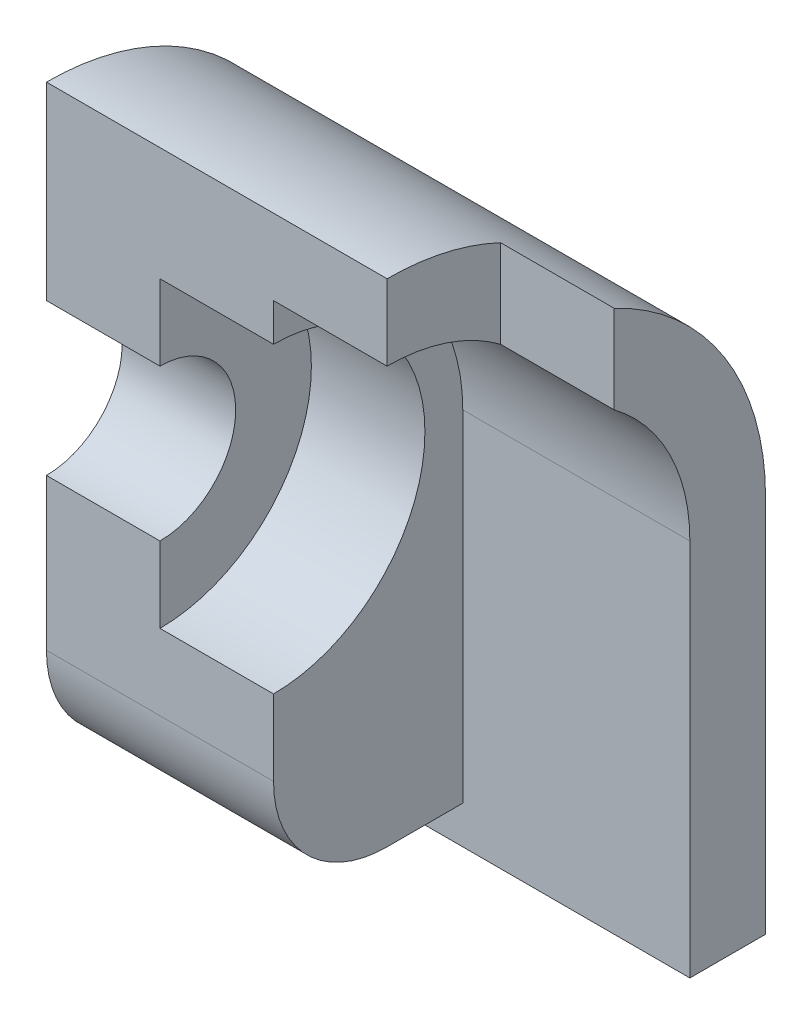
ISO-10303-21;
HEADER;
FILE_DESCRIPTION(('STEP AP214'),'2;1');
FILE_NAME('part.step','',(''),(''),'','','');
FILE_SCHEMA(('AUTOMOTIVE_DESIGN { 1 0 10303 214 1 1 1 1 }'));
ENDSEC;
DATA;
#1=APPLICATION_CONTEXT('core data for automotive mechanical design processes');
#2=APPLICATION_PROTOCOL_DEFINITION('international standard','automotive_design',2000,#1);
#3=PRODUCT_CONTEXT('',#1,'mechanical');
#4=PRODUCT('Part','Part','',(#3));
#5=PRODUCT_RELATED_PRODUCT_CATEGORY('part','',(#4));
#6=PRODUCT_DEFINITION_FORMATION('','',#4);
#7=PRODUCT_DEFINITION_CONTEXT('part definition',#1,'design');
#8=PRODUCT_DEFINITION('design','',#6,#7);
#9=PRODUCT_DEFINITION_SHAPE('','',#8);
#10=(LENGTH_UNIT() NAMED_UNIT(*) SI_UNIT(.MILLI.,.METRE.));
#11=(NAMED_UNIT(*) PLANE_ANGLE_UNIT() SI_UNIT($,.RADIAN.));
#12=(NAMED_UNIT(*) SI_UNIT($,.STERADIAN.) SOLID_ANGLE_UNIT());
#13=UNCERTAINTY_MEASURE_WITH_UNIT(LENGTH_MEASURE(1.E-05),#10,'distance_accuracy_value','');
#14=(GEOMETRIC_REPRESENTATION_CONTEXT(3) GLOBAL_UNCERTAINTY_ASSIGNED_CONTEXT((#13)) GLOBAL_UNIT_ASSIGNED_CONTEXT((#10,
#11,#12)) REPRESENTATION_CONTEXT('',''));
#15=CARTESIAN_POINT('',(0.,0.,0.));
#16=DIRECTION('',(0.,0.,1.));
#17=DIRECTION('',(1.,0.,0.));
#18=AXIS2_PLACEMENT_3D('',#15,#16,#17);
#19=CARTESIAN_POINT('',(12.,1.,3.5));
#20=DIRECTION('',(-1.,0.,0.));
#21=DIRECTION('',(0.,0.,1.));
#22=AXIS2_PLACEMENT_3D('',#19,#20,#21);
#23=CYLINDRICAL_SURFACE('',#22,2.);
#24=DIRECTION('',(-1.,0.,0.));
#25=VECTOR('',#24,1.);
#26=CARTESIAN_POINT('',(12.,-0.999999999999997,3.5));
#27=LINE('',#26,#25);
#28=CARTESIAN_POINT('',(3.,-0.999999999999997,3.5));
#29=VERTEX_POINT('',#28);
#30=CARTESIAN_POINT('',(0.,-0.999999999999997,3.5));
#31=VERTEX_POINT('',#30);
#32=EDGE_CURVE('E184',#29,#31,#27,.T.);
#33=ORIENTED_EDGE('',*,*,#32,.F.);
#34=CARTESIAN_POINT('',(3.,1.,3.5));
#35=DIRECTION('',(1.,0.,0.));
#36=DIRECTION('',(0.,0.,-1.));
#37=AXIS2_PLACEMENT_3D('',#34,#35,#36);
#38=CIRCLE('',#37,2.);
#39=CARTESIAN_POINT('',(3.,3.,3.5));
#40=VERTEX_POINT('',#39);
#41=EDGE_CURVE('E269',#29,#40,#38,.T.);
#42=ORIENTED_EDGE('',*,*,#41,.T.);
#43=DIRECTION('',(-1.,0.,0.));
#44=VECTOR('',#43,1.);
#45=CARTESIAN_POINT('',(12.,3.,3.5));
#46=LINE('',#45,#44);
#47=CARTESIAN_POINT('',(0.,3.,3.5));
#48=VERTEX_POINT('',#47);
#49=EDGE_CURVE('E156',#40,#48,#46,.T.);
#50=ORIENTED_EDGE('',*,*,#49,.T.);
#51=CARTESIAN_POINT('',(0.,1.,3.5));
#52=DIRECTION('',(1.,0.,0.));
#53=DIRECTION('',(0.,0.,-1.));
#54=AXIS2_PLACEMENT_3D('',#51,#52,#53);
#55=CIRCLE('',#54,2.);
#56=EDGE_CURVE('E235',#31,#48,#55,.T.);
#57=ORIENTED_EDGE('',*,*,#56,.F.);
#58=EDGE_LOOP('',(#33,#42,#50,#57));
#59=FACE_BOUND('',#58,.T.);
#60=ADVANCED_FACE('F35',(#59),#23,.F.);
#61=CARTESIAN_POINT('',(12.,0.,3.5));
#62=DIRECTION('',(0.,0.,1.));
#63=DIRECTION('',(1.,0.,0.));
#64=AXIS2_PLACEMENT_3D('',#61,#62,#63);
#65=PLANE('',#64);
#66=DIRECTION('',(1.,0.,0.));
#67=VECTOR('',#66,1.);
#68=CARTESIAN_POINT('',(3.,-3.,3.5));
#69=LINE('',#68,#67);
#70=CARTESIAN_POINT('',(3.,-3.,3.5));
#71=VERTEX_POINT('',#70);
#72=CARTESIAN_POINT('',(6.,-3.,3.5));
#73=VERTEX_POINT('',#72);
#74=EDGE_CURVE('E49',#71,#73,#69,.T.);
#75=ORIENTED_EDGE('',*,*,#74,.F.);
#76=DIRECTION('',(0.,1.,0.));
#77=VECTOR('',#76,1.);
#78=CARTESIAN_POINT('',(3.,0.,3.5));
#79=LINE('',#78,#77);
#80=EDGE_CURVE('E151',#71,#29,#79,.T.);
#81=ORIENTED_EDGE('',*,*,#80,.T.);
#82=ORIENTED_EDGE('',*,*,#32,.T.);
#83=DIRECTION('',(0.,1.,0.));
#84=VECTOR('',#83,1.);
#85=CARTESIAN_POINT('',(0.,0.,3.5));
#86=LINE('',#85,#84);
#87=CARTESIAN_POINT('',(0.,-4.99999999999998,3.5));
#88=VERTEX_POINT('',#87);
#89=EDGE_CURVE('E244',#88,#31,#86,.T.);
#90=ORIENTED_EDGE('',*,*,#89,.F.);
#91=DIRECTION('',(-1.,0.,0.));
#92=VECTOR('',#91,1.);
#93=CARTESIAN_POINT('',(12.,-4.99999999999998,3.5));
#94=LINE('',#93,#92);
#95=CARTESIAN_POINT('',(6.,-4.99999999999998,3.5));
#96=VERTEX_POINT('',#95);
#97=EDGE_CURVE('E182',#96,#88,#94,.T.);
#98=ORIENTED_EDGE('',*,*,#97,.F.);
#99=DIRECTION('',(0.,1.,0.));
#100=VECTOR('',#99,1.);
#101=CARTESIAN_POINT('',(6.,0.,3.5));
#102=LINE('',#101,#100);
#103=EDGE_CURVE('E202',#96,#73,#102,.T.);
#104=ORIENTED_EDGE('',*,*,#103,.T.);
#105=EDGE_LOOP('',(#75,#81,#82,#90,#98,#104));
#106=FACE_BOUND('',#105,.T.);
#107=ADVANCED_FACE('F271',(#106),#65,.T.);
#108=CARTESIAN_POINT('',(12.,-5.,0.500000000000001));
#109=DIRECTION('',(-1.,0.,0.));
#110=DIRECTION('',(0.,0.,1.));
#111=AXIS2_PLACEMENT_3D('',#108,#109,#110);
#112=CYLINDRICAL_SURFACE('',#111,3.);
#113=DIRECTION('',(-1.,0.,0.));
#114=VECTOR('',#113,1.);
#115=CARTESIAN_POINT('',(12.,-8.,0.499999999999979));
#116=LINE('',#115,#114);
#117=CARTESIAN_POINT('',(6.,-8.,0.499999999999979));
#118=VERTEX_POINT('',#117);
#119=CARTESIAN_POINT('',(0.,-8.,0.499999999999979));
#120=VERTEX_POINT('',#119);
#121=EDGE_CURVE('E180',#118,#120,#116,.T.);
#122=ORIENTED_EDGE('',*,*,#121,.F.);
#123=CARTESIAN_POINT('',(6.,-5.,0.500000000000001));
#124=DIRECTION('',(1.,0.,0.));
#125=DIRECTION('',(0.,0.,-1.));
#126=AXIS2_PLACEMENT_3D('',#123,#124,#125);
#127=CIRCLE('',#126,3.);
#128=EDGE_CURVE('E220',#118,#96,#127,.F.);
#129=ORIENTED_EDGE('',*,*,#128,.T.);
#130=ORIENTED_EDGE('',*,*,#97,.T.);
#131=CARTESIAN_POINT('',(0.,-5.,0.500000000000001));
#132=DIRECTION('',(1.,0.,0.));
#133=DIRECTION('',(0.,0.,-1.));
#134=AXIS2_PLACEMENT_3D('',#131,#132,#133);
#135=CIRCLE('',#134,3.);
#136=EDGE_CURVE('E247',#120,#88,#135,.F.);
#137=ORIENTED_EDGE('',*,*,#136,.F.);
#138=EDGE_LOOP('',(#122,#129,#130,#137));
#139=FACE_BOUND('',#138,.T.);
#140=ADVANCED_FACE('F276',(#139),#112,.T.);
#141=CARTESIAN_POINT('',(12.,-8.,0.));
#142=DIRECTION('',(0.,-1.,0.));
#143=DIRECTION('',(0.,0.,-1.));
#144=AXIS2_PLACEMENT_3D('',#141,#142,#143);
#145=PLANE('',#144);
#146=DIRECTION('',(-1.,0.,0.));
#147=VECTOR('',#146,1.);
#148=CARTESIAN_POINT('',(12.,-8.,-1.5));
#149=LINE('',#148,#147);
#150=CARTESIAN_POINT('',(6.,-8.,-1.5));
#151=VERTEX_POINT('',#150);
#152=CARTESIAN_POINT('',(0.,-8.,-1.5));
#153=VERTEX_POINT('',#152);
#154=EDGE_CURVE('E178',#151,#153,#149,.T.);
#155=ORIENTED_EDGE('',*,*,#154,.F.);
#156=DIRECTION('',(0.,0.,1.));
#157=VECTOR('',#156,1.);
#158=CARTESIAN_POINT('',(6.,-8.,0.));
#159=LINE('',#158,#157);
#160=EDGE_CURVE('E223',#151,#118,#159,.T.);
#161=ORIENTED_EDGE('',*,*,#160,.T.);
#162=ORIENTED_EDGE('',*,*,#121,.T.);
#163=DIRECTION('',(0.,0.,1.));
#164=VECTOR('',#163,1.);
#165=CARTESIAN_POINT('',(0.,-8.,0.));
#166=LINE('',#165,#164);
#167=EDGE_CURVE('E250',#153,#120,#166,.T.);
#168=ORIENTED_EDGE('',*,*,#167,.F.);
#169=EDGE_LOOP('',(#155,#161,#162,#168));
#170=FACE_BOUND('',#169,.T.);
#171=ADVANCED_FACE('F281',(#170),#145,.T.);
#172=CARTESIAN_POINT('',(12.,0.,-1.5));
#173=DIRECTION('',(0.,0.,-1.));
#174=DIRECTION('',(-1.,0.,0.));
#175=AXIS2_PLACEMENT_3D('',#172,#173,#174);
#176=PLANE('',#175);
#177=DIRECTION('',(-1.,0.,0.));
#178=VECTOR('',#177,1.);
#179=CARTESIAN_POINT('',(12.,-9.,-1.5));
#180=LINE('',#179,#178);
#181=CARTESIAN_POINT('',(12.,-9.,-1.5));
#182=VERTEX_POINT('',#181);
#183=CARTESIAN_POINT('',(0.,-9.,-1.5));
#184=VERTEX_POINT('',#183);
#185=EDGE_CURVE('E176',#182,#184,#180,.T.);
#186=ORIENTED_EDGE('',*,*,#185,.F.);
#187=DIRECTION('',(0.,-1.,0.));
#188=VECTOR('',#187,1.);
#189=CARTESIAN_POINT('',(12.,0.,-1.5));
#190=LINE('',#189,#188);
#191=CARTESIAN_POINT('',(12.,1.,-1.5));
#192=VERTEX_POINT('',#191);
#193=EDGE_CURVE('E236',#192,#182,#190,.T.);
#194=ORIENTED_EDGE('',*,*,#193,.F.);
#195=DIRECTION('',(1.,0.,0.));
#196=VECTOR('',#195,1.);
#197=CARTESIAN_POINT('',(6.,1.,-1.5));
#198=LINE('',#197,#196);
#199=CARTESIAN_POINT('',(6.,1.,-1.5));
#200=VERTEX_POINT('',#199);
#201=EDGE_CURVE('E210',#200,#192,#198,.T.);
#202=ORIENTED_EDGE('',*,*,#201,.F.);
#203=DIRECTION('',(0.,1.,0.));
#204=VECTOR('',#203,1.);
#205=CARTESIAN_POINT('',(6.,1.,-1.5));
#206=LINE('',#205,#204);
#207=EDGE_CURVE('E206',#151,#200,#206,.T.);
#208=ORIENTED_EDGE('',*,*,#207,.F.);
#209=ORIENTED_EDGE('',*,*,#154,.T.);
#210=DIRECTION('',(0.,-1.,0.));
#211=VECTOR('',#210,1.);
#212=CARTESIAN_POINT('',(0.,0.,-1.5));
#213=LINE('',#212,#211);
#214=EDGE_CURVE('E253',#153,#184,#213,.T.);
#215=ORIENTED_EDGE('',*,*,#214,.T.);
#216=EDGE_LOOP('',(#186,#194,#202,#208,#209,#215));
#217=FACE_BOUND('',#216,.T.);
#218=ADVANCED_FACE('F284',(#217),#176,.F.);
#219=CARTESIAN_POINT('',(12.,-9.,0.));
#220=DIRECTION('',(0.,-1.,0.));
#221=DIRECTION('',(0.,0.,-1.));
#222=AXIS2_PLACEMENT_3D('',#219,#220,#221);
#223=PLANE('',#222);
#224=DIRECTION('',(0.,0.,1.));
#225=VECTOR('',#224,1.);
#226=CARTESIAN_POINT('',(0.,-9.,0.));
#227=LINE('',#226,#225);
#228=CARTESIAN_POINT('',(0.,-9.,-3.5));
#229=VERTEX_POINT('',#228);
#230=EDGE_CURVE('E256',#229,#184,#227,.T.);
#231=ORIENTED_EDGE('',*,*,#230,.F.);
#232=DIRECTION('',(-1.,0.,0.));
#233=VECTOR('',#232,1.);
#234=CARTESIAN_POINT('',(12.,-9.,-3.5));
#235=LINE('',#234,#233);
#236=CARTESIAN_POINT('',(12.,-9.,-3.5));
#237=VERTEX_POINT('',#236);
#238=EDGE_CURVE('E174',#237,#229,#235,.T.);
#239=ORIENTED_EDGE('',*,*,#238,.F.);
#240=DIRECTION('',(0.,0.,1.));
#241=VECTOR('',#240,1.);
#242=CARTESIAN_POINT('',(12.,-9.,0.));
#243=LINE('',#242,#241);
#244=EDGE_CURVE('E238',#237,#182,#243,.T.);
#245=ORIENTED_EDGE('',*,*,#244,.T.);
#246=ORIENTED_EDGE('',*,*,#185,.T.);
#247=EDGE_LOOP('',(#231,#239,#245,#246));
#248=FACE_BOUND('',#247,.T.);
#249=ADVANCED_FACE('F306',(#248),#223,.T.);
#250=CARTESIAN_POINT('',(12.,0.,-3.5));
#251=DIRECTION('',(0.,0.,1.));
#252=DIRECTION('',(1.,0.,0.));
#253=AXIS2_PLACEMENT_3D('',#250,#251,#252);
#254=PLANE('',#253);
#255=DIRECTION('',(0.,1.,0.));
#256=VECTOR('',#255,1.);
#257=CARTESIAN_POINT('',(0.,0.,-3.5));
#258=LINE('',#257,#256);
#259=CARTESIAN_POINT('',(0.,1.,-3.5));
#260=VERTEX_POINT('',#259);
#261=EDGE_CURVE('E258',#229,#260,#258,.T.);
#262=ORIENTED_EDGE('',*,*,#261,.T.);
#263=DIRECTION('',(-1.,0.,0.));
#264=VECTOR('',#263,1.);
#265=CARTESIAN_POINT('',(12.,1.,-3.5));
#266=LINE('',#265,#264);
#267=CARTESIAN_POINT('',(12.,1.,-3.5));
#268=VERTEX_POINT('',#267);
#269=EDGE_CURVE('E165',#268,#260,#266,.T.);
#270=ORIENTED_EDGE('',*,*,#269,.F.);
#271=DIRECTION('',(0.,1.,0.));
#272=VECTOR('',#271,1.);
#273=CARTESIAN_POINT('',(12.,0.,-3.5));
#274=LINE('',#273,#272);
#275=EDGE_CURVE('E167',#237,#268,#274,.T.);
#276=ORIENTED_EDGE('',*,*,#275,.F.);
#277=ORIENTED_EDGE('',*,*,#238,.T.);
#278=EDGE_LOOP('',(#262,#270,#276,#277));
#279=FACE_BOUND('',#278,.T.);
#280=ADVANCED_FACE('F303',(#279),#254,.F.);
#281=CARTESIAN_POINT('',(12.,1.,3.5));
#282=DIRECTION('',(-1.,0.,0.));
#283=DIRECTION('',(0.,0.,1.));
#284=AXIS2_PLACEMENT_3D('',#281,#282,#283);
#285=CYLINDRICAL_SURFACE('',#284,7.);
#286=DIRECTION('',(-1.,0.,0.));
#287=VECTOR('',#286,1.);
#288=CARTESIAN_POINT('',(12.,7.32455532033675,0.499999999999979));
#289=LINE('',#288,#287);
#290=CARTESIAN_POINT('',(12.,7.32455532033675,0.499999999999979));
#291=VERTEX_POINT('',#290);
#292=CARTESIAN_POINT('',(9.,7.32455532033675,0.499999999999979));
#293=VERTEX_POINT('',#292);
#294=EDGE_CURVE('E230',#291,#293,#289,.T.);
#295=ORIENTED_EDGE('',*,*,#294,.F.);
#296=CARTESIAN_POINT('',(12.,1.,3.5));
#297=DIRECTION('',(1.,0.,0.));
#298=DIRECTION('',(0.,0.,-1.));
#299=AXIS2_PLACEMENT_3D('',#296,#297,#298);
#300=CIRCLE('',#299,7.);
#301=EDGE_CURVE('E163',#291,#268,#300,.F.);
#302=ORIENTED_EDGE('',*,*,#301,.T.);
#303=ORIENTED_EDGE('',*,*,#269,.T.);
#304=CARTESIAN_POINT('',(0.,1.,3.5));
#305=DIRECTION('',(1.,0.,0.));
#306=DIRECTION('',(0.,0.,-1.));
#307=AXIS2_PLACEMENT_3D('',#304,#305,#306);
#308=CIRCLE('',#307,7.);
#309=CARTESIAN_POINT('',(0.,8.,3.5));
#310=VERTEX_POINT('',#309);
#311=EDGE_CURVE('E170',#310,#260,#308,.F.);
#312=ORIENTED_EDGE('',*,*,#311,.F.);
#313=DIRECTION('',(-1.,0.,0.));
#314=VECTOR('',#313,1.);
#315=CARTESIAN_POINT('',(12.,8.,3.5));
#316=LINE('',#315,#314);
#317=CARTESIAN_POINT('',(9.,8.,3.5));
#318=VERTEX_POINT('',#317);
#319=EDGE_CURVE('E162',#318,#310,#316,.T.);
#320=ORIENTED_EDGE('',*,*,#319,.F.);
#321=CARTESIAN_POINT('',(9.,1.,3.5));
#322=DIRECTION('',(-1.,0.,0.));
#323=DIRECTION('',(0.,0.,1.));
#324=AXIS2_PLACEMENT_3D('',#321,#322,#323);
#325=CIRCLE('',#324,7.);
#326=EDGE_CURVE('E233',#293,#318,#325,.F.);
#327=ORIENTED_EDGE('',*,*,#326,.F.);
#328=EDGE_LOOP('',(#295,#302,#303,#312,#320,#327));
#329=FACE_BOUND('',#328,.T.);
#330=ADVANCED_FACE('F298',(#329),#285,.T.);
#331=DIRECTION('',(1.,0.,0.));
#332=VECTOR('',#331,1.);
#333=CARTESIAN_POINT('',(3.,5.,3.5));
#334=LINE('',#333,#332);
#335=CARTESIAN_POINT('',(6.,5.,3.5));
#336=VERTEX_POINT('',#335);
#337=CARTESIAN_POINT('',(3.,5.,3.5));
#338=VERTEX_POINT('',#337);
#339=EDGE_CURVE('E140',#336,#338,#334,.F.);
#340=ORIENTED_EDGE('',*,*,#339,.F.);
#341=DIRECTION('',(0.,1.,0.));
#342=VECTOR('',#341,1.);
#343=CARTESIAN_POINT('',(6.,0.,3.5));
#344=LINE('',#343,#342);
#345=CARTESIAN_POINT('',(6.,6.,3.5));
#346=VERTEX_POINT('',#345);
#347=EDGE_CURVE('E190',#336,#346,#344,.T.);
#348=ORIENTED_EDGE('',*,*,#347,.T.);
#349=DIRECTION('',(1.,0.,0.));
#350=VECTOR('',#349,1.);
#351=CARTESIAN_POINT('',(6.,6.,3.5));
#352=LINE('',#351,#350);
#353=CARTESIAN_POINT('',(9.,6.,3.5));
#354=VERTEX_POINT('',#353);
#355=EDGE_CURVE('E194',#354,#346,#352,.F.);
#356=ORIENTED_EDGE('',*,*,#355,.F.);
#357=DIRECTION('',(0.,-1.,0.));
#358=VECTOR('',#357,1.);
#359=CARTESIAN_POINT('',(9.,13.,3.5));
#360=LINE('',#359,#358);
#361=EDGE_CURVE('E226',#318,#354,#360,.T.);
#362=ORIENTED_EDGE('',*,*,#361,.F.);
#363=ORIENTED_EDGE('',*,*,#319,.T.);
#364=EDGE_CURVE('E158',#48,#310,#86,.T.);
#365=ORIENTED_EDGE('',*,*,#364,.F.);
#366=ORIENTED_EDGE('',*,*,#49,.F.);
#367=DIRECTION('',(0.,1.,0.));
#368=VECTOR('',#367,1.);
#369=CARTESIAN_POINT('',(3.,0.,3.5));
#370=LINE('',#369,#368);
#371=EDGE_CURVE('E11',#40,#338,#370,.T.);
#372=ORIENTED_EDGE('',*,*,#371,.T.);
#373=EDGE_LOOP('',(#340,#348,#356,#362,#363,#365,#366,#372));
#374=FACE_BOUND('',#373,.T.);
#375=ADVANCED_FACE('F154',(#374),#65,.T.);
#376=CARTESIAN_POINT('',(12.,0.,0.));
#377=DIRECTION('',(1.,0.,0.));
#378=DIRECTION('',(0.,0.,-1.));
#379=AXIS2_PLACEMENT_3D('',#376,#377,#378);
#380=PLANE('',#379);
#381=CARTESIAN_POINT('',(12.,1.,3.5));
#382=DIRECTION('',(1.,0.,0.));
#383=DIRECTION('',(0.,0.,-1.));
#384=AXIS2_PLACEMENT_3D('',#381,#382,#383);
#385=CIRCLE('',#384,5.);
#386=CARTESIAN_POINT('',(12.,4.99999999999999,0.499999999999979));
#387=VERTEX_POINT('',#386);
#388=EDGE_CURVE('E208',#192,#387,#385,.T.);
#389=ORIENTED_EDGE('',*,*,#388,.F.);
#390=ORIENTED_EDGE('',*,*,#193,.T.);
#391=ORIENTED_EDGE('',*,*,#244,.F.);
#392=ORIENTED_EDGE('',*,*,#275,.T.);
#393=ORIENTED_EDGE('',*,*,#301,.F.);
#394=DIRECTION('',(0.,1.,0.));
#395=VECTOR('',#394,1.);
#396=CARTESIAN_POINT('',(12.,0.,0.499999999999979));
#397=LINE('',#396,#395);
#398=EDGE_CURVE('E186',#387,#291,#397,.T.);
#399=ORIENTED_EDGE('',*,*,#398,.F.);
#400=EDGE_LOOP('',(#389,#390,#391,#392,#393,#399));
#401=FACE_BOUND('',#400,.T.);
#402=ADVANCED_FACE('F289',(#401),#380,.T.);
#403=CARTESIAN_POINT('',(0.,0.,0.));
#404=DIRECTION('',(1.,0.,0.));
#405=DIRECTION('',(0.,0.,-1.));
#406=AXIS2_PLACEMENT_3D('',#403,#404,#405);
#407=PLANE('',#406);
#408=ORIENTED_EDGE('',*,*,#56,.T.);
#409=ORIENTED_EDGE('',*,*,#364,.T.);
#410=ORIENTED_EDGE('',*,*,#311,.T.);
#411=ORIENTED_EDGE('',*,*,#261,.F.);
#412=ORIENTED_EDGE('',*,*,#230,.T.);
#413=ORIENTED_EDGE('',*,*,#214,.F.);
#414=ORIENTED_EDGE('',*,*,#167,.T.);
#415=ORIENTED_EDGE('',*,*,#136,.T.);
#416=ORIENTED_EDGE('',*,*,#89,.T.);
#417=EDGE_LOOP('',(#408,#409,#410,#411,#412,#413,#414,#415,#416));
#418=FACE_BOUND('',#417,.T.);
#419=ADVANCED_FACE('F266',(#418),#407,.F.);
#420=CARTESIAN_POINT('',(12.,13.,0.499999999999979));
#421=DIRECTION('',(0.,0.,-1.));
#422=DIRECTION('',(-1.,0.,0.));
#423=AXIS2_PLACEMENT_3D('',#420,#421,#422);
#424=PLANE('',#423);
#425=DIRECTION('',(0.,-1.,0.));
#426=VECTOR('',#425,1.);
#427=CARTESIAN_POINT('',(9.,13.,0.499999999999979));
#428=LINE('',#427,#426);
#429=CARTESIAN_POINT('',(9.,4.99999999999999,0.499999999999979));
#430=VERTEX_POINT('',#429);
#431=EDGE_CURVE('E227',#293,#430,#428,.T.);
#432=ORIENTED_EDGE('',*,*,#431,.T.);
#433=DIRECTION('',(1.,0.,0.));
#434=VECTOR('',#433,1.);
#435=CARTESIAN_POINT('',(6.,4.99999999999999,0.499999999999979));
#436=LINE('',#435,#434);
#437=EDGE_CURVE('E57',#430,#387,#436,.T.);
#438=ORIENTED_EDGE('',*,*,#437,.T.);
#439=ORIENTED_EDGE('',*,*,#398,.T.);
#440=ORIENTED_EDGE('',*,*,#294,.T.);
#441=EDGE_LOOP('',(#432,#438,#439,#440));
#442=FACE_BOUND('',#441,.T.);
#443=ADVANCED_FACE('F294',(#442),#424,.F.);
#444=CARTESIAN_POINT('',(9.,13.,3.5));
#445=DIRECTION('',(-1.,0.,0.));
#446=DIRECTION('',(0.,0.,1.));
#447=AXIS2_PLACEMENT_3D('',#444,#445,#446);
#448=PLANE('',#447);
#449=ORIENTED_EDGE('',*,*,#361,.T.);
#450=CARTESIAN_POINT('',(9.,1.,3.5));
#451=DIRECTION('',(-1.,0.,0.));
#452=DIRECTION('',(0.,0.,1.));
#453=AXIS2_PLACEMENT_3D('',#450,#451,#452);
#454=CIRCLE('',#453,5.);
#455=EDGE_CURVE('E188',#354,#430,#454,.T.);
#456=ORIENTED_EDGE('',*,*,#455,.T.);
#457=ORIENTED_EDGE('',*,*,#431,.F.);
#458=ORIENTED_EDGE('',*,*,#326,.T.);
#459=EDGE_LOOP('',(#449,#456,#457,#458));
#460=FACE_BOUND('',#459,.T.);
#461=ADVANCED_FACE('F301',(#460),#448,.F.);
#462=CARTESIAN_POINT('',(6.,1.,3.5));
#463=DIRECTION('',(1.,0.,0.));
#464=DIRECTION('',(0.,0.,-1.));
#465=AXIS2_PLACEMENT_3D('',#462,#463,#464);
#466=CYLINDRICAL_SURFACE('',#465,5.);
#467=ORIENTED_EDGE('',*,*,#355,.T.);
#468=CARTESIAN_POINT('',(6.,1.,3.5));
#469=DIRECTION('',(1.,0.,0.));
#470=DIRECTION('',(0.,0.,-1.));
#471=AXIS2_PLACEMENT_3D('',#468,#469,#470);
#472=CIRCLE('',#471,5.);
#473=EDGE_CURVE('E201',#200,#346,#472,.T.);
#474=ORIENTED_EDGE('',*,*,#473,.F.);
#475=ORIENTED_EDGE('',*,*,#201,.T.);
#476=ORIENTED_EDGE('',*,*,#388,.T.);
#477=ORIENTED_EDGE('',*,*,#437,.F.);
#478=ORIENTED_EDGE('',*,*,#455,.F.);
#479=EDGE_LOOP('',(#467,#474,#475,#476,#477,#478));
#480=FACE_BOUND('',#479,.T.);
#481=ADVANCED_FACE('F199',(#480),#466,.F.);
#482=CARTESIAN_POINT('',(6.,1.,3.5));
#483=DIRECTION('',(1.,0.,0.));
#484=DIRECTION('',(0.,0.,-1.));
#485=AXIS2_PLACEMENT_3D('',#482,#483,#484);
#486=PLANE('',#485);
#487=CARTESIAN_POINT('',(6.,1.,3.5));
#488=DIRECTION('',(1.,0.,0.));
#489=DIRECTION('',(0.,0.,-1.));
#490=AXIS2_PLACEMENT_3D('',#487,#488,#489);
#491=CIRCLE('',#490,4.);
#492=EDGE_CURVE('E42',#73,#336,#491,.T.);
#493=ORIENTED_EDGE('',*,*,#492,.F.);
#494=ORIENTED_EDGE('',*,*,#103,.F.);
#495=ORIENTED_EDGE('',*,*,#128,.F.);
#496=ORIENTED_EDGE('',*,*,#160,.F.);
#497=ORIENTED_EDGE('',*,*,#207,.T.);
#498=ORIENTED_EDGE('',*,*,#473,.T.);
#499=ORIENTED_EDGE('',*,*,#347,.F.);
#500=EDGE_LOOP('',(#493,#494,#495,#496,#497,#498,#499));
#501=FACE_BOUND('',#500,.T.);
#502=ADVANCED_FACE('F204',(#501),#486,.T.);
#503=CARTESIAN_POINT('',(3.,1.,3.5));
#504=DIRECTION('',(1.,0.,0.));
#505=DIRECTION('',(0.,0.,-1.));
#506=AXIS2_PLACEMENT_3D('',#503,#504,#505);
#507=CYLINDRICAL_SURFACE('',#506,4.);
#508=ORIENTED_EDGE('',*,*,#74,.T.);
#509=ORIENTED_EDGE('',*,*,#492,.T.);
#510=ORIENTED_EDGE('',*,*,#339,.T.);
#511=CARTESIAN_POINT('',(3.,1.,3.5));
#512=DIRECTION('',(1.,0.,0.));
#513=DIRECTION('',(0.,0.,-1.));
#514=AXIS2_PLACEMENT_3D('',#511,#512,#513);
#515=CIRCLE('',#514,4.);
#516=EDGE_CURVE('E143',#71,#338,#515,.T.);
#517=ORIENTED_EDGE('',*,*,#516,.F.);
#518=EDGE_LOOP('',(#508,#509,#510,#517));
#519=FACE_BOUND('',#518,.T.);
#520=ADVANCED_FACE('F142',(#519),#507,.F.);
#521=CARTESIAN_POINT('',(3.,1.,3.5));
#522=DIRECTION('',(1.,0.,0.));
#523=DIRECTION('',(0.,0.,-1.));
#524=AXIS2_PLACEMENT_3D('',#521,#522,#523);
#525=PLANE('',#524);
#526=ORIENTED_EDGE('',*,*,#516,.T.);
#527=ORIENTED_EDGE('',*,*,#371,.F.);
#528=ORIENTED_EDGE('',*,*,#41,.F.);
#529=ORIENTED_EDGE('',*,*,#80,.F.);
#530=EDGE_LOOP('',(#526,#527,#528,#529));
#531=FACE_BOUND('',#530,.T.);
#532=ADVANCED_FACE('F148',(#531),#525,.T.);
#533=CLOSED_SHELL('',(#60,#107,#140,#171,#218,#249,#280,#330,#375,#402,#419,#443,#461,#481,#502,
#520,#532));
#534=MANIFOLD_SOLID_BREP('B2',#533);
#535=ADVANCED_BREP_SHAPE_REPRESENTATION('',(#18,#534),#14);
#536=SHAPE_DEFINITION_REPRESENTATION(#9,#535);
ENDSEC;
END-ISO-10303-21;
